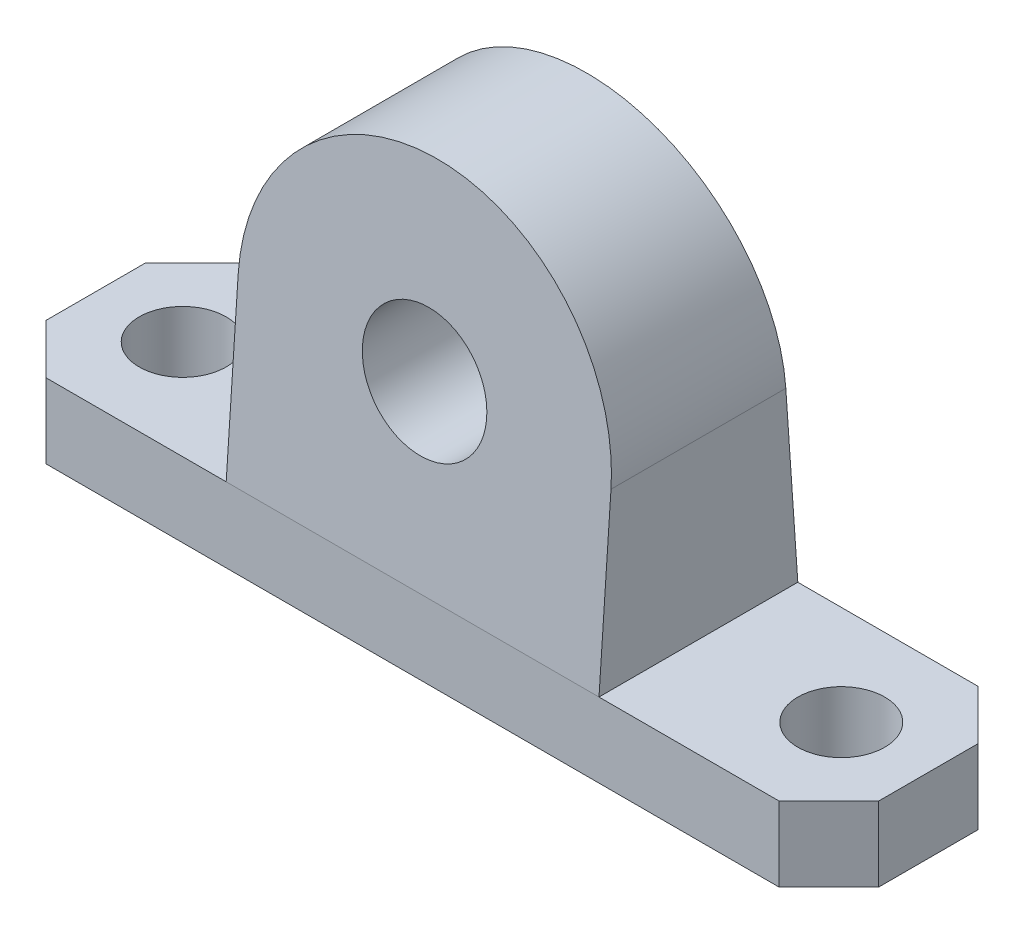
ISO-10303-21;
HEADER;
FILE_DESCRIPTION(('STEP AP214'),'2;1');
FILE_NAME('part.step','',(''),(''),'','','');
FILE_SCHEMA(('AUTOMOTIVE_DESIGN { 1 0 10303 214 1 1 1 1 }'));
ENDSEC;
DATA;
#1=APPLICATION_CONTEXT('core data for automotive mechanical design processes');
#2=APPLICATION_PROTOCOL_DEFINITION('international standard','automotive_design',2000,#1);
#3=PRODUCT_CONTEXT('',#1,'mechanical');
#4=PRODUCT('Part','Part','',(#3));
#5=PRODUCT_RELATED_PRODUCT_CATEGORY('part','',(#4));
#6=PRODUCT_DEFINITION_FORMATION('','',#4);
#7=PRODUCT_DEFINITION_CONTEXT('part definition',#1,'design');
#8=PRODUCT_DEFINITION('design','',#6,#7);
#9=PRODUCT_DEFINITION_SHAPE('','',#8);
#10=(LENGTH_UNIT() NAMED_UNIT(*) SI_UNIT(.MILLI.,.METRE.));
#11=(NAMED_UNIT(*) PLANE_ANGLE_UNIT() SI_UNIT($,.RADIAN.));
#12=(NAMED_UNIT(*) SI_UNIT($,.STERADIAN.) SOLID_ANGLE_UNIT());
#13=UNCERTAINTY_MEASURE_WITH_UNIT(LENGTH_MEASURE(1.E-05),#10,'distance_accuracy_value','');
#14=(GEOMETRIC_REPRESENTATION_CONTEXT(3) GLOBAL_UNCERTAINTY_ASSIGNED_CONTEXT((#13)) GLOBAL_UNIT_ASSIGNED_CONTEXT((#10,
#11,#12)) REPRESENTATION_CONTEXT('',''));
#15=CARTESIAN_POINT('',(0.,0.,0.));
#16=DIRECTION('',(0.,0.,1.));
#17=DIRECTION('',(1.,0.,0.));
#18=AXIS2_PLACEMENT_3D('',#15,#16,#17);
#19=CARTESIAN_POINT('',(15.,35.,-6.));
#20=DIRECTION('',(0.,-0.0688020916153781,0.997630328422983));
#21=DIRECTION('',(0.,-0.997630328422983,-0.0688020916153781));
#22=AXIS2_PLACEMENT_3D('',#19,#20,#21);
#23=PLANE('',#22);
#24=CARTESIAN_POINT('',(0.,20.,-7.03448275862069));
#25=DIRECTION('',(0.,-0.0688020916153781,0.997630328422983));
#26=DIRECTION('',(0.,0.997630328422983,0.0688020916153781));
#27=AXIS2_PLACEMENT_3D('',#24,#25,#26);
#28=ELLIPSE('',#27,15.0356295038779,15.);
#29=CARTESIAN_POINT('',(-15.,20.,-7.03448275862069));
#30=VERTEX_POINT('',#29);
#31=CARTESIAN_POINT('',(15.,20.,-7.03448275862069));
#32=VERTEX_POINT('',#31);
#33=EDGE_CURVE('E195',#30,#32,#28,.F.);
#34=ORIENTED_EDGE('',*,*,#33,.T.);
#35=DIRECTION('',(0.,0.997630328422983,0.0688020916153781));
#36=VECTOR('',#35,1.);
#37=CARTESIAN_POINT('',(15.,35.,-6.));
#38=LINE('',#37,#36);
#39=CARTESIAN_POINT('',(15.,6.,-8.));
#40=VERTEX_POINT('',#39);
#41=EDGE_CURVE('E254',#40,#32,#38,.T.);
#42=ORIENTED_EDGE('',*,*,#41,.F.);
#43=DIRECTION('',(-1.,0.,0.));
#44=VECTOR('',#43,1.);
#45=CARTESIAN_POINT('',(15.,6.,-8.));
#46=LINE('',#45,#44);
#47=CARTESIAN_POINT('',(-15.,6.,-8.));
#48=VERTEX_POINT('',#47);
#49=EDGE_CURVE('E230',#40,#48,#46,.T.);
#50=ORIENTED_EDGE('',*,*,#49,.T.);
#51=DIRECTION('',(0.,0.997630328422983,0.0688020916153781));
#52=VECTOR('',#51,1.);
#53=CARTESIAN_POINT('',(-15.,35.,-6.));
#54=LINE('',#53,#52);
#55=EDGE_CURVE('E67',#48,#30,#54,.T.);
#56=ORIENTED_EDGE('',*,*,#55,.T.);
#57=EDGE_LOOP('',(#34,#42,#50,#56));
#58=FACE_BOUND('',#57,.T.);
#59=CARTESIAN_POINT('',(0.,20.,-7.03448275862069));
#60=DIRECTION('',(0.,-0.0688020916153781,0.997630328422983));
#61=DIRECTION('',(0.,0.997630328422983,0.0688020916153781));
#62=AXIS2_PLACEMENT_3D('',#59,#60,#61);
#63=ELLIPSE('',#62,7.01662710180968,7.);
#64=CARTESIAN_POINT('',(0.,27.,-6.55172413793103));
#65=VERTEX_POINT('',#64);
#66=EDGE_CURVE('E12',#65,#65,#63,.F.);
#67=ORIENTED_EDGE('',*,*,#66,.F.);
#68=EDGE_LOOP('',(#67));
#69=FACE_BOUND('',#68,.T.);
#70=ADVANCED_FACE('F52',(#58,#69),#23,.F.);
#71=CARTESIAN_POINT('',(-29.5,6.,-8.));
#72=DIRECTION('',(0.,0.,1.));
#73=DIRECTION('',(1.,0.,0.));
#74=AXIS2_PLACEMENT_3D('',#71,#72,#73);
#75=PLANE('',#74);
#76=DIRECTION('',(-1.,0.,0.));
#77=VECTOR('',#76,1.);
#78=CARTESIAN_POINT('',(-29.5,6.,-8.));
#79=LINE('',#78,#77);
#80=CARTESIAN_POINT('',(-29.5,6.,-8.));
#81=VERTEX_POINT('',#80);
#82=EDGE_CURVE('E118',#48,#81,#79,.T.);
#83=ORIENTED_EDGE('',*,*,#82,.F.);
#84=ORIENTED_EDGE('',*,*,#49,.F.);
#85=CARTESIAN_POINT('',(29.5,6.,-8.));
#86=VERTEX_POINT('',#85);
#87=EDGE_CURVE('E235',#86,#40,#79,.T.);
#88=ORIENTED_EDGE('',*,*,#87,.F.);
#89=DIRECTION('',(0.,-1.,0.));
#90=VECTOR('',#89,1.);
#91=CARTESIAN_POINT('',(29.5,6.,-8.));
#92=LINE('',#91,#90);
#93=CARTESIAN_POINT('',(29.5,0.,-8.));
#94=VERTEX_POINT('',#93);
#95=EDGE_CURVE('E160',#86,#94,#92,.T.);
#96=ORIENTED_EDGE('',*,*,#95,.T.);
#97=DIRECTION('',(-1.,0.,0.));
#98=VECTOR('',#97,1.);
#99=CARTESIAN_POINT('',(-29.5,0.,-8.));
#100=LINE('',#99,#98);
#101=CARTESIAN_POINT('',(-29.5,0.,-8.));
#102=VERTEX_POINT('',#101);
#103=EDGE_CURVE('E164',#94,#102,#100,.T.);
#104=ORIENTED_EDGE('',*,*,#103,.T.);
#105=DIRECTION('',(0.,-1.,0.));
#106=VECTOR('',#105,1.);
#107=CARTESIAN_POINT('',(-29.5,6.,-8.));
#108=LINE('',#107,#106);
#109=EDGE_CURVE('E192',#81,#102,#108,.T.);
#110=ORIENTED_EDGE('',*,*,#109,.F.);
#111=EDGE_LOOP('',(#83,#84,#88,#96,#104,#110));
#112=FACE_BOUND('',#111,.T.);
#113=ADVANCED_FACE('F54',(#112),#75,.F.);
#114=CARTESIAN_POINT('',(-29.5,6.,8.));
#115=DIRECTION('',(0.,0.,-1.));
#116=DIRECTION('',(-1.,0.,0.));
#117=AXIS2_PLACEMENT_3D('',#114,#115,#116);
#118=PLANE('',#117);
#119=DIRECTION('',(1.,0.,0.));
#120=VECTOR('',#119,1.);
#121=CARTESIAN_POINT('',(-29.5,6.,8.));
#122=LINE('',#121,#120);
#123=CARTESIAN_POINT('',(15.,6.,8.));
#124=VERTEX_POINT('',#123);
#125=CARTESIAN_POINT('',(29.5,6.,8.));
#126=VERTEX_POINT('',#125);
#127=EDGE_CURVE('E142',#124,#126,#122,.T.);
#128=ORIENTED_EDGE('',*,*,#127,.F.);
#129=DIRECTION('',(-1.,0.,0.));
#130=VECTOR('',#129,1.);
#131=CARTESIAN_POINT('',(15.,6.,8.));
#132=LINE('',#131,#130);
#133=CARTESIAN_POINT('',(-15.,6.,8.));
#134=VERTEX_POINT('',#133);
#135=EDGE_CURVE('E252',#124,#134,#132,.T.);
#136=ORIENTED_EDGE('',*,*,#135,.T.);
#137=CARTESIAN_POINT('',(-29.5,6.,8.));
#138=VERTEX_POINT('',#137);
#139=EDGE_CURVE('E146',#138,#134,#122,.T.);
#140=ORIENTED_EDGE('',*,*,#139,.F.);
#141=DIRECTION('',(0.,-1.,0.));
#142=VECTOR('',#141,1.);
#143=CARTESIAN_POINT('',(-29.5,6.,8.));
#144=LINE('',#143,#142);
#145=CARTESIAN_POINT('',(-29.5,0.,8.));
#146=VERTEX_POINT('',#145);
#147=EDGE_CURVE('E183',#138,#146,#144,.T.);
#148=ORIENTED_EDGE('',*,*,#147,.T.);
#149=DIRECTION('',(1.,0.,0.));
#150=VECTOR('',#149,1.);
#151=CARTESIAN_POINT('',(-29.5,0.,8.));
#152=LINE('',#151,#150);
#153=CARTESIAN_POINT('',(29.5,0.,8.));
#154=VERTEX_POINT('',#153);
#155=EDGE_CURVE('E174',#146,#154,#152,.T.);
#156=ORIENTED_EDGE('',*,*,#155,.T.);
#157=DIRECTION('',(0.,-1.,0.));
#158=VECTOR('',#157,1.);
#159=CARTESIAN_POINT('',(29.5,6.,8.));
#160=LINE('',#159,#158);
#161=EDGE_CURVE('E155',#126,#154,#160,.T.);
#162=ORIENTED_EDGE('',*,*,#161,.F.);
#163=EDGE_LOOP('',(#128,#136,#140,#148,#156,#162));
#164=FACE_BOUND('',#163,.T.);
#165=ADVANCED_FACE('F250',(#164),#118,.F.);
#166=CARTESIAN_POINT('',(-15.,35.,8.));
#167=DIRECTION('',(1.,0.,0.));
#168=DIRECTION('',(0.,0.,-1.));
#169=AXIS2_PLACEMENT_3D('',#166,#167,#168);
#170=PLANE('',#169);
#171=DIRECTION('',(0.,0.,1.));
#172=VECTOR('',#171,1.);
#173=CARTESIAN_POINT('',(-15.,6.,8.));
#174=LINE('',#173,#172);
#175=EDGE_CURVE('E168',#48,#134,#174,.T.);
#176=ORIENTED_EDGE('',*,*,#175,.T.);
#177=DIRECTION('',(0.,-0.997630328422983,0.068802091615378));
#178=VECTOR('',#177,1.);
#179=CARTESIAN_POINT('',(-15.,6.,8.));
#180=LINE('',#179,#178);
#181=CARTESIAN_POINT('',(-15.,20.,7.03448275862069));
#182=VERTEX_POINT('',#181);
#183=EDGE_CURVE('E206',#182,#134,#180,.T.);
#184=ORIENTED_EDGE('',*,*,#183,.F.);
#185=DIRECTION('',(0.,0.,1.));
#186=VECTOR('',#185,1.);
#187=CARTESIAN_POINT('',(-15.,20.,-29.2132034355964));
#188=LINE('',#187,#186);
#189=EDGE_CURVE('E221',#30,#182,#188,.T.);
#190=ORIENTED_EDGE('',*,*,#189,.F.);
#191=ORIENTED_EDGE('',*,*,#55,.F.);
#192=EDGE_LOOP('',(#176,#184,#190,#191));
#193=FACE_BOUND('',#192,.T.);
#194=ADVANCED_FACE('F220',(#193),#170,.F.);
#195=CARTESIAN_POINT('',(0.,6.,0.));
#196=DIRECTION('',(0.,1.,0.));
#197=DIRECTION('',(0.,0.,1.));
#198=AXIS2_PLACEMENT_3D('',#195,#196,#197);
#199=PLANE('',#198);
#200=CARTESIAN_POINT('',(26.5,6.,0.));
#201=DIRECTION('',(0.,-1.,0.));
#202=DIRECTION('',(0.,0.,-1.));
#203=AXIS2_PLACEMENT_3D('',#200,#201,#202);
#204=CIRCLE('',#203,3.5);
#205=CARTESIAN_POINT('',(26.5,6.,-3.5));
#206=VERTEX_POINT('',#205);
#207=EDGE_CURVE('E483',#206,#206,#204,.T.);
#208=ORIENTED_EDGE('',*,*,#207,.T.);
#209=EDGE_LOOP('',(#208));
#210=FACE_BOUND('',#209,.T.);
#211=DIRECTION('',(0.,0.,-1.));
#212=VECTOR('',#211,1.);
#213=CARTESIAN_POINT('',(15.,6.,8.));
#214=LINE('',#213,#212);
#215=EDGE_CURVE('E225',#124,#40,#214,.T.);
#216=ORIENTED_EDGE('',*,*,#215,.F.);
#217=ORIENTED_EDGE('',*,*,#127,.T.);
#218=DIRECTION('',(0.707106781186548,0.,-0.707106781186548));
#219=VECTOR('',#218,1.);
#220=CARTESIAN_POINT('',(33.5,6.,4.));
#221=LINE('',#220,#219);
#222=CARTESIAN_POINT('',(33.5,6.,4.));
#223=VERTEX_POINT('',#222);
#224=EDGE_CURVE('E134',#126,#223,#221,.T.);
#225=ORIENTED_EDGE('',*,*,#224,.T.);
#226=DIRECTION('',(0.,0.,-1.));
#227=VECTOR('',#226,1.);
#228=CARTESIAN_POINT('',(33.5,6.,4.));
#229=LINE('',#228,#227);
#230=CARTESIAN_POINT('',(33.5,6.,-4.));
#231=VERTEX_POINT('',#230);
#232=EDGE_CURVE('E139',#223,#231,#229,.T.);
#233=ORIENTED_EDGE('',*,*,#232,.T.);
#234=DIRECTION('',(-0.707106781186548,0.,-0.707106781186548));
#235=VECTOR('',#234,1.);
#236=CARTESIAN_POINT('',(29.5,6.,-8.));
#237=LINE('',#236,#235);
#238=EDGE_CURVE('E76',#231,#86,#237,.T.);
#239=ORIENTED_EDGE('',*,*,#238,.T.);
#240=ORIENTED_EDGE('',*,*,#87,.T.);
#241=EDGE_LOOP('',(#216,#217,#225,#233,#239,#240));
#242=FACE_BOUND('',#241,.T.);
#243=ADVANCED_FACE('F137',(#210,#242),#199,.T.);
#244=CARTESIAN_POINT('',(-29.5,6.,-8.));
#245=DIRECTION('',(0.707106781186547,0.,0.707106781186547));
#246=DIRECTION('',(0.707106781186548,0.,-0.707106781186548));
#247=AXIS2_PLACEMENT_3D('',#244,#245,#246);
#248=PLANE('',#247);
#249=DIRECTION('',(-0.707106781186548,0.,0.707106781186548));
#250=VECTOR('',#249,1.);
#251=CARTESIAN_POINT('',(-29.5,0.,-8.));
#252=LINE('',#251,#250);
#253=CARTESIAN_POINT('',(-33.5,0.,-4.));
#254=VERTEX_POINT('',#253);
#255=EDGE_CURVE('E167',#102,#254,#252,.T.);
#256=ORIENTED_EDGE('',*,*,#255,.T.);
#257=DIRECTION('',(0.,-1.,0.));
#258=VECTOR('',#257,1.);
#259=CARTESIAN_POINT('',(-33.5,6.,-4.));
#260=LINE('',#259,#258);
#261=CARTESIAN_POINT('',(-33.5,6.,-4.));
#262=VERTEX_POINT('',#261);
#263=EDGE_CURVE('E189',#262,#254,#260,.T.);
#264=ORIENTED_EDGE('',*,*,#263,.F.);
#265=DIRECTION('',(-0.707106781186548,0.,0.707106781186548));
#266=VECTOR('',#265,1.);
#267=CARTESIAN_POINT('',(-29.5,6.,-8.));
#268=LINE('',#267,#266);
#269=EDGE_CURVE('E237',#81,#262,#268,.T.);
#270=ORIENTED_EDGE('',*,*,#269,.F.);
#271=ORIENTED_EDGE('',*,*,#109,.T.);
#272=EDGE_LOOP('',(#256,#264,#270,#271));
#273=FACE_BOUND('',#272,.T.);
#274=ADVANCED_FACE('F295',(#273),#248,.F.);
#275=CARTESIAN_POINT('',(-33.5,6.,4.));
#276=DIRECTION('',(1.,0.,0.));
#277=DIRECTION('',(0.,0.,-1.));
#278=AXIS2_PLACEMENT_3D('',#275,#276,#277);
#279=PLANE('',#278);
#280=DIRECTION('',(0.,0.,1.));
#281=VECTOR('',#280,1.);
#282=CARTESIAN_POINT('',(-33.5,0.,4.));
#283=LINE('',#282,#281);
#284=CARTESIAN_POINT('',(-33.5,0.,4.));
#285=VERTEX_POINT('',#284);
#286=EDGE_CURVE('E170',#254,#285,#283,.T.);
#287=ORIENTED_EDGE('',*,*,#286,.T.);
#288=DIRECTION('',(0.,-1.,0.));
#289=VECTOR('',#288,1.);
#290=CARTESIAN_POINT('',(-33.5,6.,4.));
#291=LINE('',#290,#289);
#292=CARTESIAN_POINT('',(-33.5,6.,4.));
#293=VERTEX_POINT('',#292);
#294=EDGE_CURVE('E186',#293,#285,#291,.T.);
#295=ORIENTED_EDGE('',*,*,#294,.F.);
#296=DIRECTION('',(0.,0.,1.));
#297=VECTOR('',#296,1.);
#298=CARTESIAN_POINT('',(-33.5,6.,4.));
#299=LINE('',#298,#297);
#300=EDGE_CURVE('E239',#262,#293,#299,.T.);
#301=ORIENTED_EDGE('',*,*,#300,.F.);
#302=ORIENTED_EDGE('',*,*,#263,.T.);
#303=EDGE_LOOP('',(#287,#295,#301,#302));
#304=FACE_BOUND('',#303,.T.);
#305=ADVANCED_FACE('F306',(#304),#279,.F.);
#306=CARTESIAN_POINT('',(-33.5,6.,4.));
#307=DIRECTION('',(0.707106781186547,0.,-0.707106781186547));
#308=DIRECTION('',(-0.707106781186548,0.,-0.707106781186548));
#309=AXIS2_PLACEMENT_3D('',#306,#307,#308);
#310=PLANE('',#309);
#311=DIRECTION('',(0.707106781186548,0.,0.707106781186548));
#312=VECTOR('',#311,1.);
#313=CARTESIAN_POINT('',(-33.5,0.,4.));
#314=LINE('',#313,#312);
#315=EDGE_CURVE('E172',#285,#146,#314,.T.);
#316=ORIENTED_EDGE('',*,*,#315,.T.);
#317=ORIENTED_EDGE('',*,*,#147,.F.);
#318=DIRECTION('',(0.707106781186548,0.,0.707106781186548));
#319=VECTOR('',#318,1.);
#320=CARTESIAN_POINT('',(-33.5,6.,4.));
#321=LINE('',#320,#319);
#322=EDGE_CURVE('E241',#293,#138,#321,.T.);
#323=ORIENTED_EDGE('',*,*,#322,.F.);
#324=ORIENTED_EDGE('',*,*,#294,.T.);
#325=EDGE_LOOP('',(#316,#317,#323,#324));
#326=FACE_BOUND('',#325,.T.);
#327=ADVANCED_FACE('F303',(#326),#310,.F.);
#328=CARTESIAN_POINT('',(33.5,6.,4.));
#329=DIRECTION('',(-0.707106781186547,0.,-0.707106781186547));
#330=DIRECTION('',(-0.707106781186548,0.,0.707106781186548));
#331=AXIS2_PLACEMENT_3D('',#328,#329,#330);
#332=PLANE('',#331);
#333=DIRECTION('',(0.707106781186548,0.,-0.707106781186548));
#334=VECTOR('',#333,1.);
#335=CARTESIAN_POINT('',(33.5,0.,4.));
#336=LINE('',#335,#334);
#337=CARTESIAN_POINT('',(33.5,0.,4.));
#338=VERTEX_POINT('',#337);
#339=EDGE_CURVE('E152',#154,#338,#336,.T.);
#340=ORIENTED_EDGE('',*,*,#339,.T.);
#341=DIRECTION('',(0.,-1.,0.));
#342=VECTOR('',#341,1.);
#343=CARTESIAN_POINT('',(33.5,6.,4.));
#344=LINE('',#343,#342);
#345=EDGE_CURVE('E149',#223,#338,#344,.T.);
#346=ORIENTED_EDGE('',*,*,#345,.F.);
#347=ORIENTED_EDGE('',*,*,#224,.F.);
#348=ORIENTED_EDGE('',*,*,#161,.T.);
#349=EDGE_LOOP('',(#340,#346,#347,#348));
#350=FACE_BOUND('',#349,.T.);
#351=ADVANCED_FACE('F150',(#350),#332,.F.);
#352=CARTESIAN_POINT('',(33.5,6.,4.));
#353=DIRECTION('',(-1.,0.,0.));
#354=DIRECTION('',(0.,0.,1.));
#355=AXIS2_PLACEMENT_3D('',#352,#353,#354);
#356=PLANE('',#355);
#357=DIRECTION('',(0.,0.,-1.));
#358=VECTOR('',#357,1.);
#359=CARTESIAN_POINT('',(33.5,0.,4.));
#360=LINE('',#359,#358);
#361=CARTESIAN_POINT('',(33.5,0.,-4.));
#362=VERTEX_POINT('',#361);
#363=EDGE_CURVE('E177',#338,#362,#360,.T.);
#364=ORIENTED_EDGE('',*,*,#363,.T.);
#365=DIRECTION('',(0.,-1.,0.));
#366=VECTOR('',#365,1.);
#367=CARTESIAN_POINT('',(33.5,6.,-4.));
#368=LINE('',#367,#366);
#369=EDGE_CURVE('E156',#231,#362,#368,.T.);
#370=ORIENTED_EDGE('',*,*,#369,.F.);
#371=ORIENTED_EDGE('',*,*,#232,.F.);
#372=ORIENTED_EDGE('',*,*,#345,.T.);
#373=EDGE_LOOP('',(#364,#370,#371,#372));
#374=FACE_BOUND('',#373,.T.);
#375=ADVANCED_FACE('F158',(#374),#356,.F.);
#376=CARTESIAN_POINT('',(29.5,6.,-8.));
#377=DIRECTION('',(-0.707106781186547,0.,0.707106781186547));
#378=DIRECTION('',(0.707106781186548,0.,0.707106781186548));
#379=AXIS2_PLACEMENT_3D('',#376,#377,#378);
#380=PLANE('',#379);
#381=DIRECTION('',(-0.707106781186548,0.,-0.707106781186548));
#382=VECTOR('',#381,1.);
#383=CARTESIAN_POINT('',(29.5,0.,-8.));
#384=LINE('',#383,#382);
#385=EDGE_CURVE('E109',#362,#94,#384,.T.);
#386=ORIENTED_EDGE('',*,*,#385,.T.);
#387=ORIENTED_EDGE('',*,*,#95,.F.);
#388=ORIENTED_EDGE('',*,*,#238,.F.);
#389=ORIENTED_EDGE('',*,*,#369,.T.);
#390=EDGE_LOOP('',(#386,#387,#388,#389));
#391=FACE_BOUND('',#390,.T.);
#392=ADVANCED_FACE('F321',(#391),#380,.F.);
#393=CARTESIAN_POINT('',(-26.5,6.,0.));
#394=DIRECTION('',(0.,-1.,0.));
#395=DIRECTION('',(0.,0.,-1.));
#396=AXIS2_PLACEMENT_3D('',#393,#394,#395);
#397=CIRCLE('',#396,3.5);
#398=CARTESIAN_POINT('',(-26.5,6.,-3.5));
#399=VERTEX_POINT('',#398);
#400=EDGE_CURVE('E222',#399,#399,#397,.T.);
#401=ORIENTED_EDGE('',*,*,#400,.T.);
#402=EDGE_LOOP('',(#401));
#403=FACE_BOUND('',#402,.T.);
#404=ORIENTED_EDGE('',*,*,#175,.F.);
#405=ORIENTED_EDGE('',*,*,#82,.T.);
#406=ORIENTED_EDGE('',*,*,#269,.T.);
#407=ORIENTED_EDGE('',*,*,#300,.T.);
#408=ORIENTED_EDGE('',*,*,#322,.T.);
#409=ORIENTED_EDGE('',*,*,#139,.T.);
#410=EDGE_LOOP('',(#404,#405,#406,#407,#408,#409));
#411=FACE_BOUND('',#410,.T.);
#412=ADVANCED_FACE('F244',(#403,#411),#199,.T.);
#413=CARTESIAN_POINT('',(0.,0.,0.));
#414=DIRECTION('',(0.,1.,0.));
#415=DIRECTION('',(0.,0.,1.));
#416=AXIS2_PLACEMENT_3D('',#413,#414,#415);
#417=PLANE('',#416);
#418=CARTESIAN_POINT('',(26.5,0.,0.));
#419=DIRECTION('',(0.,-1.,0.));
#420=DIRECTION('',(0.,0.,-1.));
#421=AXIS2_PLACEMENT_3D('',#418,#419,#420);
#422=CIRCLE('',#421,3.5);
#423=CARTESIAN_POINT('',(26.5,0.,-3.5));
#424=VERTEX_POINT('',#423);
#425=EDGE_CURVE('E478',#424,#424,#422,.T.);
#426=ORIENTED_EDGE('',*,*,#425,.F.);
#427=EDGE_LOOP('',(#426));
#428=FACE_BOUND('',#427,.T.);
#429=CARTESIAN_POINT('',(-26.5,0.,0.));
#430=DIRECTION('',(0.,-1.,0.));
#431=DIRECTION('',(0.,0.,-1.));
#432=AXIS2_PLACEMENT_3D('',#429,#430,#431);
#433=CIRCLE('',#432,3.5);
#434=CARTESIAN_POINT('',(-26.5,0.,-3.5));
#435=VERTEX_POINT('',#434);
#436=EDGE_CURVE('E486',#435,#435,#433,.T.);
#437=ORIENTED_EDGE('',*,*,#436,.F.);
#438=EDGE_LOOP('',(#437));
#439=FACE_BOUND('',#438,.T.);
#440=ORIENTED_EDGE('',*,*,#103,.F.);
#441=ORIENTED_EDGE('',*,*,#385,.F.);
#442=ORIENTED_EDGE('',*,*,#363,.F.);
#443=ORIENTED_EDGE('',*,*,#339,.F.);
#444=ORIENTED_EDGE('',*,*,#155,.F.);
#445=ORIENTED_EDGE('',*,*,#315,.F.);
#446=ORIENTED_EDGE('',*,*,#286,.F.);
#447=ORIENTED_EDGE('',*,*,#255,.F.);
#448=EDGE_LOOP('',(#440,#441,#442,#443,#444,#445,#446,#447));
#449=FACE_BOUND('',#448,.T.);
#450=ADVANCED_FACE('F272',(#428,#439,#449),#417,.F.);
#451=CARTESIAN_POINT('',(15.,35.,8.));
#452=DIRECTION('',(-1.,0.,0.));
#453=DIRECTION('',(0.,0.,1.));
#454=AXIS2_PLACEMENT_3D('',#451,#452,#453);
#455=PLANE('',#454);
#456=DIRECTION('',(0.,0.,1.));
#457=VECTOR('',#456,1.);
#458=CARTESIAN_POINT('',(15.,20.,-29.2132034355964));
#459=LINE('',#458,#457);
#460=CARTESIAN_POINT('',(15.,20.,7.03448275862069));
#461=VERTEX_POINT('',#460);
#462=EDGE_CURVE('E226',#32,#461,#459,.T.);
#463=ORIENTED_EDGE('',*,*,#462,.T.);
#464=DIRECTION('',(0.,-0.997630328422983,0.068802091615378));
#465=VECTOR('',#464,1.);
#466=CARTESIAN_POINT('',(15.,6.,8.));
#467=LINE('',#466,#465);
#468=EDGE_CURVE('E210',#461,#124,#467,.T.);
#469=ORIENTED_EDGE('',*,*,#468,.T.);
#470=ORIENTED_EDGE('',*,*,#215,.T.);
#471=ORIENTED_EDGE('',*,*,#41,.T.);
#472=EDGE_LOOP('',(#463,#469,#470,#471));
#473=FACE_BOUND('',#472,.T.);
#474=ADVANCED_FACE('F268',(#473),#455,.F.);
#475=CARTESIAN_POINT('',(0.,20.,-29.2132034355964));
#476=DIRECTION('',(0.,0.,1.));
#477=DIRECTION('',(1.,0.,0.));
#478=AXIS2_PLACEMENT_3D('',#475,#476,#477);
#479=CYLINDRICAL_SURFACE('',#478,15.);
#480=CARTESIAN_POINT('',(0.,20.,7.0344827586207));
#481=DIRECTION('',(0.,-0.068802091615378,-0.997630328422983));
#482=DIRECTION('',(0.,-0.997630328422983,0.068802091615378));
#483=AXIS2_PLACEMENT_3D('',#480,#481,#482);
#484=ELLIPSE('',#483,15.0356295038779,15.);
#485=EDGE_CURVE('E60',#461,#182,#484,.F.);
#486=ORIENTED_EDGE('',*,*,#485,.F.);
#487=ORIENTED_EDGE('',*,*,#462,.F.);
#488=ORIENTED_EDGE('',*,*,#33,.F.);
#489=ORIENTED_EDGE('',*,*,#189,.T.);
#490=EDGE_LOOP('',(#486,#487,#488,#489));
#491=FACE_BOUND('',#490,.T.);
#492=ADVANCED_FACE('F224',(#491),#479,.T.);
#493=CARTESIAN_POINT('',(15.,6.,8.));
#494=DIRECTION('',(0.,-0.068802091615378,-0.997630328422983));
#495=DIRECTION('',(0.,0.997630328422983,-0.068802091615378));
#496=AXIS2_PLACEMENT_3D('',#493,#494,#495);
#497=PLANE('',#496);
#498=CARTESIAN_POINT('',(0.,20.,7.03448275862069));
#499=DIRECTION('',(0.,-0.068802091615378,-0.997630328422983));
#500=DIRECTION('',(0.,0.997630328422983,-0.068802091615378));
#501=AXIS2_PLACEMENT_3D('',#498,#499,#500);
#502=ELLIPSE('',#501,5.01187650129263,5.);
#503=CARTESIAN_POINT('',(0.,25.,6.68965517241379));
#504=VERTEX_POINT('',#503);
#505=EDGE_CURVE('E474',#504,#504,#502,.F.);
#506=ORIENTED_EDGE('',*,*,#505,.F.);
#507=EDGE_LOOP('',(#506));
#508=FACE_BOUND('',#507,.T.);
#509=ORIENTED_EDGE('',*,*,#468,.F.);
#510=ORIENTED_EDGE('',*,*,#485,.T.);
#511=ORIENTED_EDGE('',*,*,#183,.T.);
#512=ORIENTED_EDGE('',*,*,#135,.F.);
#513=EDGE_LOOP('',(#509,#510,#511,#512));
#514=FACE_BOUND('',#513,.T.);
#515=ADVANCED_FACE('F203',(#508,#514),#497,.F.);
#516=CARTESIAN_POINT('',(-26.5,6.,0.));
#517=DIRECTION('',(0.,-1.,0.));
#518=DIRECTION('',(0.,0.,-1.));
#519=AXIS2_PLACEMENT_3D('',#516,#517,#518);
#520=CYLINDRICAL_SURFACE('',#519,3.5);
#521=ORIENTED_EDGE('',*,*,#400,.F.);
#522=EDGE_LOOP('',(#521));
#523=FACE_BOUND('',#522,.T.);
#524=ORIENTED_EDGE('',*,*,#436,.T.);
#525=EDGE_LOOP('',(#524));
#526=FACE_BOUND('',#525,.T.);
#527=ADVANCED_FACE('F415',(#523,#526),#520,.F.);
#528=CARTESIAN_POINT('',(26.5,6.,0.));
#529=DIRECTION('',(0.,-1.,0.));
#530=DIRECTION('',(0.,0.,-1.));
#531=AXIS2_PLACEMENT_3D('',#528,#529,#530);
#532=CYLINDRICAL_SURFACE('',#531,3.5);
#533=ORIENTED_EDGE('',*,*,#207,.F.);
#534=EDGE_LOOP('',(#533));
#535=FACE_BOUND('',#534,.T.);
#536=ORIENTED_EDGE('',*,*,#425,.T.);
#537=EDGE_LOOP('',(#536));
#538=FACE_BOUND('',#537,.T.);
#539=ADVANCED_FACE('F423',(#535,#538),#532,.F.);
#540=CARTESIAN_POINT('',(0.,20.,21.1934142915532));
#541=DIRECTION('',(0.,0.,-1.));
#542=DIRECTION('',(-1.,0.,0.));
#543=AXIS2_PLACEMENT_3D('',#540,#541,#542);
#544=CYLINDRICAL_SURFACE('',#543,5.);
#545=ORIENTED_EDGE('',*,*,#505,.T.);
#546=EDGE_LOOP('',(#545));
#547=FACE_BOUND('',#546,.T.);
#548=CARTESIAN_POINT('',(0.,20.,-9.));
#549=DIRECTION('',(0.,0.,-1.));
#550=DIRECTION('',(-1.,0.,0.));
#551=AXIS2_PLACEMENT_3D('',#548,#549,#550);
#552=CIRCLE('',#551,5.);
#553=CARTESIAN_POINT('',(-5.,20.,-9.));
#554=VERTEX_POINT('',#553);
#555=EDGE_CURVE('E475',#554,#554,#552,.T.);
#556=ORIENTED_EDGE('',*,*,#555,.T.);
#557=EDGE_LOOP('',(#556));
#558=FACE_BOUND('',#557,.T.);
#559=ADVANCED_FACE('F430',(#547,#558),#544,.F.);
#560=CARTESIAN_POINT('',(0.,20.,-9.));
#561=DIRECTION('',(0.,0.,-1.));
#562=DIRECTION('',(-1.,0.,0.));
#563=AXIS2_PLACEMENT_3D('',#560,#561,#562);
#564=PLANE('',#563);
#565=CARTESIAN_POINT('',(0.,20.,-9.));
#566=DIRECTION('',(0.,0.,-1.));
#567=DIRECTION('',(-1.,0.,0.));
#568=AXIS2_PLACEMENT_3D('',#565,#566,#567);
#569=CIRCLE('',#568,7.);
#570=CARTESIAN_POINT('',(-7.,20.,-9.));
#571=VERTEX_POINT('',#570);
#572=EDGE_CURVE('E472',#571,#571,#569,.T.);
#573=ORIENTED_EDGE('',*,*,#572,.T.);
#574=EDGE_LOOP('',(#573));
#575=FACE_BOUND('',#574,.T.);
#576=ORIENTED_EDGE('',*,*,#555,.F.);
#577=EDGE_LOOP('',(#576));
#578=FACE_BOUND('',#577,.T.);
#579=ADVANCED_FACE('F439',(#575,#578),#564,.T.);
#580=CARTESIAN_POINT('',(0.,20.,-9.));
#581=DIRECTION('',(0.,0.,1.));
#582=DIRECTION('',(1.,0.,0.));
#583=AXIS2_PLACEMENT_3D('',#580,#581,#582);
#584=CYLINDRICAL_SURFACE('',#583,7.);
#585=ORIENTED_EDGE('',*,*,#572,.F.);
#586=EDGE_LOOP('',(#585));
#587=FACE_BOUND('',#586,.T.);
#588=ORIENTED_EDGE('',*,*,#66,.T.);
#589=EDGE_LOOP('',(#588));
#590=FACE_BOUND('',#589,.T.);
#591=ADVANCED_FACE('F455',(#587,#590),#584,.T.);
#592=CLOSED_SHELL('',(#70,#113,#165,#194,#243,#274,#305,#327,#351,#375,#392,#412,#450,#474,#492,
#515,#527,#539,#559,#579,#591));
#593=MANIFOLD_SOLID_BREP('B2',#592);
#594=ADVANCED_BREP_SHAPE_REPRESENTATION('',(#18,#593),#14);
#595=SHAPE_DEFINITION_REPRESENTATION(#9,#594);
ENDSEC;
END-ISO-10303-21;
